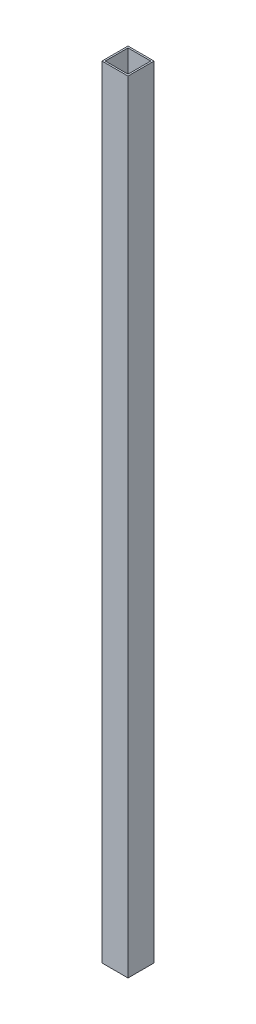
ISO-10303-21;
HEADER;
FILE_DESCRIPTION(('STEP AP214'),'2;1');
FILE_NAME('part.step','',(''),(''),'','','');
FILE_SCHEMA(('AUTOMOTIVE_DESIGN { 1 0 10303 214 1 1 1 1 }'));
ENDSEC;
DATA;
#1=APPLICATION_CONTEXT('core data for automotive mechanical design processes');
#2=APPLICATION_PROTOCOL_DEFINITION('international standard','automotive_design',2000,#1);
#3=PRODUCT_CONTEXT('',#1,'mechanical');
#4=PRODUCT('Part','Part','',(#3));
#5=PRODUCT_RELATED_PRODUCT_CATEGORY('part','',(#4));
#6=PRODUCT_DEFINITION_FORMATION('','',#4);
#7=PRODUCT_DEFINITION_CONTEXT('part definition',#1,'design');
#8=PRODUCT_DEFINITION('design','',#6,#7);
#9=PRODUCT_DEFINITION_SHAPE('','',#8);
#10=(LENGTH_UNIT() NAMED_UNIT(*) SI_UNIT(.MILLI.,.METRE.));
#11=(NAMED_UNIT(*) PLANE_ANGLE_UNIT() SI_UNIT($,.RADIAN.));
#12=(NAMED_UNIT(*) SI_UNIT($,.STERADIAN.) SOLID_ANGLE_UNIT());
#13=UNCERTAINTY_MEASURE_WITH_UNIT(LENGTH_MEASURE(1.E-05),#10,'distance_accuracy_value','');
#14=(GEOMETRIC_REPRESENTATION_CONTEXT(3) GLOBAL_UNCERTAINTY_ASSIGNED_CONTEXT((#13)) GLOBAL_UNIT_ASSIGNED_CONTEXT((#10,
#11,#12)) REPRESENTATION_CONTEXT('',''));
#15=CARTESIAN_POINT('',(0.,0.,0.));
#16=DIRECTION('',(0.,0.,1.));
#17=DIRECTION('',(1.,0.,0.));
#18=AXIS2_PLACEMENT_3D('',#15,#16,#17);
#19=CARTESIAN_POINT('',(0.,762.,0.));
#20=DIRECTION('',(0.,-1.,0.));
#21=DIRECTION('',(0.,0.,-1.));
#22=AXIS2_PLACEMENT_3D('',#19,#20,#21);
#23=PLANE('',#22);
#24=DIRECTION('',(0.,0.,1.));
#25=VECTOR('',#24,1.);
#26=CARTESIAN_POINT('',(0.,762.,0.));
#27=LINE('',#26,#25);
#28=CARTESIAN_POINT('',(0.,762.,-25.4));
#29=VERTEX_POINT('',#28);
#30=CARTESIAN_POINT('',(0.,762.,0.));
#31=VERTEX_POINT('',#30);
#32=EDGE_CURVE('E136',#29,#31,#27,.T.);
#33=ORIENTED_EDGE('',*,*,#32,.T.);
#34=DIRECTION('',(1.,0.,0.));
#35=VECTOR('',#34,1.);
#36=CARTESIAN_POINT('',(0.,762.,0.));
#37=LINE('',#36,#35);
#38=CARTESIAN_POINT('',(25.4,762.,0.));
#39=VERTEX_POINT('',#38);
#40=EDGE_CURVE('E139',#31,#39,#37,.T.);
#41=ORIENTED_EDGE('',*,*,#40,.T.);
#42=DIRECTION('',(0.,0.,-1.));
#43=VECTOR('',#42,1.);
#44=CARTESIAN_POINT('',(25.4,762.,0.));
#45=LINE('',#44,#43);
#46=CARTESIAN_POINT('',(25.4,762.,-25.4));
#47=VERTEX_POINT('',#46);
#48=EDGE_CURVE('E142',#39,#47,#45,.T.);
#49=ORIENTED_EDGE('',*,*,#48,.T.);
#50=DIRECTION('',(-1.,0.,0.));
#51=VECTOR('',#50,1.);
#52=CARTESIAN_POINT('',(0.,762.,-25.4));
#53=LINE('',#52,#51);
#54=EDGE_CURVE('E144',#47,#29,#53,.T.);
#55=ORIENTED_EDGE('',*,*,#54,.T.);
#56=EDGE_LOOP('',(#33,#41,#49,#55));
#57=FACE_BOUND('',#56,.T.);
#58=DIRECTION('',(0.,0.,1.));
#59=VECTOR('',#58,1.);
#60=CARTESIAN_POINT('',(1.6002,762.,-23.7998));
#61=LINE('',#60,#59);
#62=CARTESIAN_POINT('',(1.6002,762.,-23.7998));
#63=VERTEX_POINT('',#62);
#64=CARTESIAN_POINT('',(1.6002,762.,-1.6002));
#65=VERTEX_POINT('',#64);
#66=EDGE_CURVE('E100',#63,#65,#61,.T.);
#67=ORIENTED_EDGE('',*,*,#66,.F.);
#68=DIRECTION('',(-1.,0.,0.));
#69=VECTOR('',#68,1.);
#70=CARTESIAN_POINT('',(1.6002,762.,-23.7998));
#71=LINE('',#70,#69);
#72=CARTESIAN_POINT('',(23.7998,762.,-23.7998));
#73=VERTEX_POINT('',#72);
#74=EDGE_CURVE('E122',#73,#63,#71,.T.);
#75=ORIENTED_EDGE('',*,*,#74,.F.);
#76=DIRECTION('',(0.,0.,-1.));
#77=VECTOR('',#76,1.);
#78=CARTESIAN_POINT('',(23.7998,762.,-23.7998));
#79=LINE('',#78,#77);
#80=CARTESIAN_POINT('',(23.7998,762.,-1.6002));
#81=VERTEX_POINT('',#80);
#82=EDGE_CURVE('E120',#81,#73,#79,.T.);
#83=ORIENTED_EDGE('',*,*,#82,.F.);
#84=DIRECTION('',(1.,0.,0.));
#85=VECTOR('',#84,1.);
#86=CARTESIAN_POINT('',(1.6002,762.,-1.6002));
#87=LINE('',#86,#85);
#88=EDGE_CURVE('E108',#65,#81,#87,.T.);
#89=ORIENTED_EDGE('',*,*,#88,.F.);
#90=EDGE_LOOP('',(#67,#75,#83,#89));
#91=FACE_BOUND('',#90,.T.);
#92=ADVANCED_FACE('F35',(#57,#91),#23,.F.);
#93=CARTESIAN_POINT('',(0.,0.,0.));
#94=DIRECTION('',(0.,-1.,0.));
#95=DIRECTION('',(0.,0.,-1.));
#96=AXIS2_PLACEMENT_3D('',#93,#94,#95);
#97=PLANE('',#96);
#98=DIRECTION('',(0.,0.,1.));
#99=VECTOR('',#98,1.);
#100=CARTESIAN_POINT('',(0.,0.,0.));
#101=LINE('',#100,#99);
#102=CARTESIAN_POINT('',(0.,0.,-25.4));
#103=VERTEX_POINT('',#102);
#104=CARTESIAN_POINT('',(0.,0.,0.));
#105=VERTEX_POINT('',#104);
#106=EDGE_CURVE('E116',#103,#105,#101,.T.);
#107=ORIENTED_EDGE('',*,*,#106,.F.);
#108=DIRECTION('',(-1.,0.,0.));
#109=VECTOR('',#108,1.);
#110=CARTESIAN_POINT('',(0.,0.,-25.4));
#111=LINE('',#110,#109);
#112=CARTESIAN_POINT('',(25.4,0.,-25.4));
#113=VERTEX_POINT('',#112);
#114=EDGE_CURVE('E140',#113,#103,#111,.T.);
#115=ORIENTED_EDGE('',*,*,#114,.F.);
#116=DIRECTION('',(0.,0.,-1.));
#117=VECTOR('',#116,1.);
#118=CARTESIAN_POINT('',(25.4,0.,0.));
#119=LINE('',#118,#117);
#120=CARTESIAN_POINT('',(25.4,0.,0.));
#121=VERTEX_POINT('',#120);
#122=EDGE_CURVE('E151',#121,#113,#119,.T.);
#123=ORIENTED_EDGE('',*,*,#122,.F.);
#124=DIRECTION('',(1.,0.,0.));
#125=VECTOR('',#124,1.);
#126=CARTESIAN_POINT('',(0.,0.,0.));
#127=LINE('',#126,#125);
#128=EDGE_CURVE('E149',#105,#121,#127,.T.);
#129=ORIENTED_EDGE('',*,*,#128,.F.);
#130=EDGE_LOOP('',(#107,#115,#123,#129));
#131=FACE_BOUND('',#130,.T.);
#132=DIRECTION('',(-1.,0.,0.));
#133=VECTOR('',#132,1.);
#134=CARTESIAN_POINT('',(1.6002,0.,-23.7998));
#135=LINE('',#134,#133);
#136=CARTESIAN_POINT('',(23.7998,0.,-23.7998));
#137=VERTEX_POINT('',#136);
#138=CARTESIAN_POINT('',(1.6002,0.,-23.7998));
#139=VERTEX_POINT('',#138);
#140=EDGE_CURVE('E109',#137,#139,#135,.T.);
#141=ORIENTED_EDGE('',*,*,#140,.T.);
#142=DIRECTION('',(0.,0.,1.));
#143=VECTOR('',#142,1.);
#144=CARTESIAN_POINT('',(1.6002,0.,-23.7998));
#145=LINE('',#144,#143);
#146=CARTESIAN_POINT('',(1.6002,0.,-1.6002));
#147=VERTEX_POINT('',#146);
#148=EDGE_CURVE('E58',#139,#147,#145,.T.);
#149=ORIENTED_EDGE('',*,*,#148,.T.);
#150=DIRECTION('',(1.,0.,0.));
#151=VECTOR('',#150,1.);
#152=CARTESIAN_POINT('',(1.6002,0.,-1.6002));
#153=LINE('',#152,#151);
#154=CARTESIAN_POINT('',(23.7998,0.,-1.6002));
#155=VERTEX_POINT('',#154);
#156=EDGE_CURVE('E115',#147,#155,#153,.T.);
#157=ORIENTED_EDGE('',*,*,#156,.T.);
#158=DIRECTION('',(0.,0.,-1.));
#159=VECTOR('',#158,1.);
#160=CARTESIAN_POINT('',(23.7998,0.,-23.7998));
#161=LINE('',#160,#159);
#162=EDGE_CURVE('E128',#155,#137,#161,.T.);
#163=ORIENTED_EDGE('',*,*,#162,.T.);
#164=EDGE_LOOP('',(#141,#149,#157,#163));
#165=FACE_BOUND('',#164,.T.);
#166=ADVANCED_FACE('F169',(#131,#165),#97,.T.);
#167=CARTESIAN_POINT('',(0.,762.,0.));
#168=DIRECTION('',(1.,0.,0.));
#169=DIRECTION('',(0.,0.,-1.));
#170=AXIS2_PLACEMENT_3D('',#167,#168,#169);
#171=PLANE('',#170);
#172=ORIENTED_EDGE('',*,*,#106,.T.);
#173=DIRECTION('',(0.,-1.,0.));
#174=VECTOR('',#173,1.);
#175=CARTESIAN_POINT('',(0.,762.,0.));
#176=LINE('',#175,#174);
#177=EDGE_CURVE('E11',#31,#105,#176,.T.);
#178=ORIENTED_EDGE('',*,*,#177,.F.);
#179=ORIENTED_EDGE('',*,*,#32,.F.);
#180=DIRECTION('',(0.,-1.,0.));
#181=VECTOR('',#180,1.);
#182=CARTESIAN_POINT('',(0.,762.,-25.4));
#183=LINE('',#182,#181);
#184=EDGE_CURVE('E146',#29,#103,#183,.T.);
#185=ORIENTED_EDGE('',*,*,#184,.T.);
#186=EDGE_LOOP('',(#172,#178,#179,#185));
#187=FACE_BOUND('',#186,.T.);
#188=ADVANCED_FACE('F37',(#187),#171,.F.);
#189=CARTESIAN_POINT('',(0.,762.,0.));
#190=DIRECTION('',(0.,0.,-1.));
#191=DIRECTION('',(-1.,0.,0.));
#192=AXIS2_PLACEMENT_3D('',#189,#190,#191);
#193=PLANE('',#192);
#194=ORIENTED_EDGE('',*,*,#128,.T.);
#195=DIRECTION('',(0.,-1.,0.));
#196=VECTOR('',#195,1.);
#197=CARTESIAN_POINT('',(25.4,762.,0.));
#198=LINE('',#197,#196);
#199=EDGE_CURVE('E43',#39,#121,#198,.T.);
#200=ORIENTED_EDGE('',*,*,#199,.F.);
#201=ORIENTED_EDGE('',*,*,#40,.F.);
#202=ORIENTED_EDGE('',*,*,#177,.T.);
#203=EDGE_LOOP('',(#194,#200,#201,#202));
#204=FACE_BOUND('',#203,.T.);
#205=ADVANCED_FACE('F179',(#204),#193,.F.);
#206=CARTESIAN_POINT('',(25.4,762.,0.));
#207=DIRECTION('',(-1.,0.,0.));
#208=DIRECTION('',(0.,0.,1.));
#209=AXIS2_PLACEMENT_3D('',#206,#207,#208);
#210=PLANE('',#209);
#211=ORIENTED_EDGE('',*,*,#122,.T.);
#212=DIRECTION('',(0.,-1.,0.));
#213=VECTOR('',#212,1.);
#214=CARTESIAN_POINT('',(25.4,762.,-25.4));
#215=LINE('',#214,#213);
#216=EDGE_CURVE('E156',#47,#113,#215,.T.);
#217=ORIENTED_EDGE('',*,*,#216,.F.);
#218=ORIENTED_EDGE('',*,*,#48,.F.);
#219=ORIENTED_EDGE('',*,*,#199,.T.);
#220=EDGE_LOOP('',(#211,#217,#218,#219));
#221=FACE_BOUND('',#220,.T.);
#222=ADVANCED_FACE('F163',(#221),#210,.F.);
#223=CARTESIAN_POINT('',(0.,762.,-25.4));
#224=DIRECTION('',(0.,0.,1.));
#225=DIRECTION('',(1.,0.,0.));
#226=AXIS2_PLACEMENT_3D('',#223,#224,#225);
#227=PLANE('',#226);
#228=ORIENTED_EDGE('',*,*,#114,.T.);
#229=ORIENTED_EDGE('',*,*,#184,.F.);
#230=ORIENTED_EDGE('',*,*,#54,.F.);
#231=ORIENTED_EDGE('',*,*,#216,.T.);
#232=EDGE_LOOP('',(#228,#229,#230,#231));
#233=FACE_BOUND('',#232,.T.);
#234=ADVANCED_FACE('F173',(#233),#227,.F.);
#235=CARTESIAN_POINT('',(1.6002,762.,-23.7998));
#236=DIRECTION('',(1.,0.,0.));
#237=DIRECTION('',(0.,0.,-1.));
#238=AXIS2_PLACEMENT_3D('',#235,#236,#237);
#239=PLANE('',#238);
#240=ORIENTED_EDGE('',*,*,#148,.F.);
#241=DIRECTION('',(0.,-1.,0.));
#242=VECTOR('',#241,1.);
#243=CARTESIAN_POINT('',(1.6002,762.,-23.7998));
#244=LINE('',#243,#242);
#245=EDGE_CURVE('E104',#63,#139,#244,.T.);
#246=ORIENTED_EDGE('',*,*,#245,.F.);
#247=ORIENTED_EDGE('',*,*,#66,.T.);
#248=DIRECTION('',(0.,-1.,0.));
#249=VECTOR('',#248,1.);
#250=CARTESIAN_POINT('',(1.6002,762.,-1.6002));
#251=LINE('',#250,#249);
#252=EDGE_CURVE('E103',#65,#147,#251,.T.);
#253=ORIENTED_EDGE('',*,*,#252,.T.);
#254=EDGE_LOOP('',(#240,#246,#247,#253));
#255=FACE_BOUND('',#254,.T.);
#256=ADVANCED_FACE('F102',(#255),#239,.T.);
#257=CARTESIAN_POINT('',(1.6002,762.,-1.6002));
#258=DIRECTION('',(0.,0.,-1.));
#259=DIRECTION('',(-1.,0.,0.));
#260=AXIS2_PLACEMENT_3D('',#257,#258,#259);
#261=PLANE('',#260);
#262=ORIENTED_EDGE('',*,*,#156,.F.);
#263=ORIENTED_EDGE('',*,*,#252,.F.);
#264=ORIENTED_EDGE('',*,*,#88,.T.);
#265=DIRECTION('',(0.,-1.,0.));
#266=VECTOR('',#265,1.);
#267=CARTESIAN_POINT('',(23.7998,762.,-1.6002));
#268=LINE('',#267,#266);
#269=EDGE_CURVE('E117',#81,#155,#268,.T.);
#270=ORIENTED_EDGE('',*,*,#269,.T.);
#271=EDGE_LOOP('',(#262,#263,#264,#270));
#272=FACE_BOUND('',#271,.T.);
#273=ADVANCED_FACE('F112',(#272),#261,.T.);
#274=CARTESIAN_POINT('',(23.7998,762.,-23.7998));
#275=DIRECTION('',(-1.,0.,0.));
#276=DIRECTION('',(0.,0.,1.));
#277=AXIS2_PLACEMENT_3D('',#274,#275,#276);
#278=PLANE('',#277);
#279=ORIENTED_EDGE('',*,*,#162,.F.);
#280=ORIENTED_EDGE('',*,*,#269,.F.);
#281=ORIENTED_EDGE('',*,*,#82,.T.);
#282=DIRECTION('',(0.,-1.,0.));
#283=VECTOR('',#282,1.);
#284=CARTESIAN_POINT('',(23.7998,762.,-23.7998));
#285=LINE('',#284,#283);
#286=EDGE_CURVE('E50',#73,#137,#285,.T.);
#287=ORIENTED_EDGE('',*,*,#286,.T.);
#288=EDGE_LOOP('',(#279,#280,#281,#287));
#289=FACE_BOUND('',#288,.T.);
#290=ADVANCED_FACE('F202',(#289),#278,.T.);
#291=CARTESIAN_POINT('',(1.6002,762.,-23.7998));
#292=DIRECTION('',(0.,0.,1.));
#293=DIRECTION('',(1.,0.,0.));
#294=AXIS2_PLACEMENT_3D('',#291,#292,#293);
#295=PLANE('',#294);
#296=ORIENTED_EDGE('',*,*,#140,.F.);
#297=ORIENTED_EDGE('',*,*,#286,.F.);
#298=ORIENTED_EDGE('',*,*,#74,.T.);
#299=ORIENTED_EDGE('',*,*,#245,.T.);
#300=EDGE_LOOP('',(#296,#297,#298,#299));
#301=FACE_BOUND('',#300,.T.);
#302=ADVANCED_FACE('F206',(#301),#295,.T.);
#303=CLOSED_SHELL('',(#92,#166,#188,#205,#222,#234,#256,#273,#290,#302));
#304=MANIFOLD_SOLID_BREP('B2',#303);
#305=ADVANCED_BREP_SHAPE_REPRESENTATION('',(#18,#304),#14);
#306=SHAPE_DEFINITION_REPRESENTATION(#9,#305);
ENDSEC;
END-ISO-10303-21;
